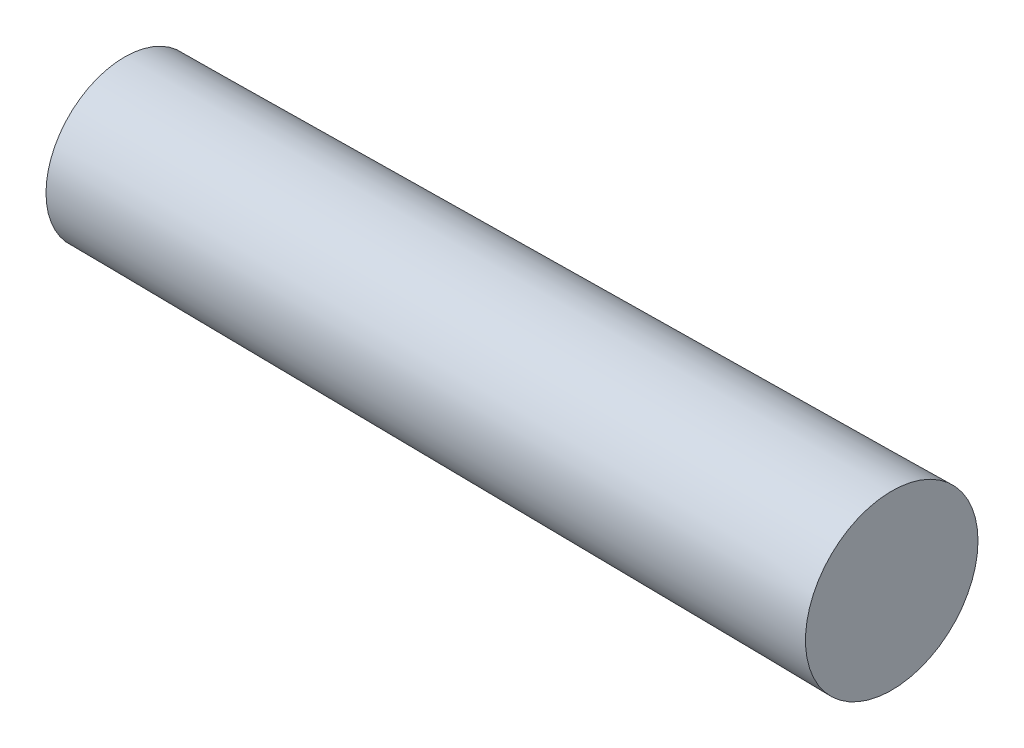
ISO-10303-21;
HEADER;
FILE_DESCRIPTION(('STEP AP214'),'2;1');
FILE_NAME('part.step','',(''),(''),'','','');
FILE_SCHEMA(('AUTOMOTIVE_DESIGN { 1 0 10303 214 1 1 1 1 }'));
ENDSEC;
DATA;
#1=APPLICATION_CONTEXT('core data for automotive mechanical design processes');
#2=APPLICATION_PROTOCOL_DEFINITION('international standard','automotive_design',2000,#1);
#3=PRODUCT_CONTEXT('',#1,'mechanical');
#4=PRODUCT('Part','Part','',(#3));
#5=PRODUCT_RELATED_PRODUCT_CATEGORY('part','',(#4));
#6=PRODUCT_DEFINITION_FORMATION('','',#4);
#7=PRODUCT_DEFINITION_CONTEXT('part definition',#1,'design');
#8=PRODUCT_DEFINITION('design','',#6,#7);
#9=PRODUCT_DEFINITION_SHAPE('','',#8);
#10=(LENGTH_UNIT() NAMED_UNIT(*) SI_UNIT(.MILLI.,.METRE.));
#11=(NAMED_UNIT(*) PLANE_ANGLE_UNIT() SI_UNIT($,.RADIAN.));
#12=(NAMED_UNIT(*) SI_UNIT($,.STERADIAN.) SOLID_ANGLE_UNIT());
#13=UNCERTAINTY_MEASURE_WITH_UNIT(LENGTH_MEASURE(1.E-05),#10,'distance_accuracy_value','');
#14=(GEOMETRIC_REPRESENTATION_CONTEXT(3) GLOBAL_UNCERTAINTY_ASSIGNED_CONTEXT((#13)) GLOBAL_UNIT_ASSIGNED_CONTEXT((#10,
#11,#12)) REPRESENTATION_CONTEXT('',''));
#15=CARTESIAN_POINT('',(0.,0.,0.));
#16=DIRECTION('',(0.,0.,1.));
#17=DIRECTION('',(1.,0.,0.));
#18=AXIS2_PLACEMENT_3D('',#15,#16,#17);
#19=CARTESIAN_POINT('',(5.88,0.,0.));
#20=DIRECTION('',(1.,0.,0.));
#21=DIRECTION('',(0.,0.,-1.));
#22=AXIS2_PLACEMENT_3D('',#19,#20,#21);
#23=CONICAL_SURFACE('',#22,0.557599999931285,0.00999966667473667);
#24=CARTESIAN_POINT('',(0.12,0.,0.));
#25=DIRECTION('',(-1.,0.,0.));
#26=DIRECTION('',(0.,0.,1.));
#27=AXIS2_PLACEMENT_3D('',#24,#25,#26);
#28=CIRCLE('',#27,0.5);
#29=CARTESIAN_POINT('',(0.12,0.,0.5));
#30=VERTEX_POINT('',#29);
#31=EDGE_CURVE('E41',#30,#30,#28,.T.);
#32=ORIENTED_EDGE('',*,*,#31,.F.);
#33=EDGE_LOOP('',(#32));
#34=FACE_BOUND('',#33,.T.);
#35=CARTESIAN_POINT('',(5.,0.,0.));
#36=DIRECTION('',(1.,0.,0.));
#37=DIRECTION('',(0.,0.,-1.));
#38=AXIS2_PLACEMENT_3D('',#35,#36,#37);
#39=CIRCLE('',#38,0.548799999941783);
#40=CARTESIAN_POINT('',(5.,0.,-0.548799999941783));
#41=VERTEX_POINT('',#40);
#42=EDGE_CURVE('E11',#41,#41,#39,.T.);
#43=ORIENTED_EDGE('',*,*,#42,.F.);
#44=EDGE_LOOP('',(#43));
#45=FACE_BOUND('',#44,.T.);
#46=ADVANCED_FACE('F34',(#34,#45),#23,.T.);
#47=CARTESIAN_POINT('',(1.10166666666667,0.,0.));
#48=DIRECTION('',(-1.,0.,0.));
#49=DIRECTION('',(0.,1.,0.));
#50=AXIS2_PLACEMENT_3D('',#47,#48,#49);
#51=SPHERICAL_SURFACE('',#50,1.10166666666667);
#52=ORIENTED_EDGE('',*,*,#31,.T.);
#53=EDGE_LOOP('',(#52));
#54=FACE_BOUND('',#53,.T.);
#55=ADVANCED_FACE('F36',(#54),#51,.T.);
#56=CARTESIAN_POINT('',(5.,0.,0.));
#57=DIRECTION('',(1.,0.,0.));
#58=DIRECTION('',(0.,0.,-1.));
#59=AXIS2_PLACEMENT_3D('',#56,#57,#58);
#60=PLANE('',#59);
#61=ORIENTED_EDGE('',*,*,#42,.T.);
#62=EDGE_LOOP('',(#61));
#63=FACE_BOUND('',#62,.T.);
#64=ADVANCED_FACE('F53',(#63),#60,.T.);
#65=CLOSED_SHELL('',(#46,#55,#64));
#66=MANIFOLD_SOLID_BREP('B2',#65);
#67=ADVANCED_BREP_SHAPE_REPRESENTATION('',(#18,#66),#14);
#68=SHAPE_DEFINITION_REPRESENTATION(#9,#67);
ENDSEC;
END-ISO-10303-21;
